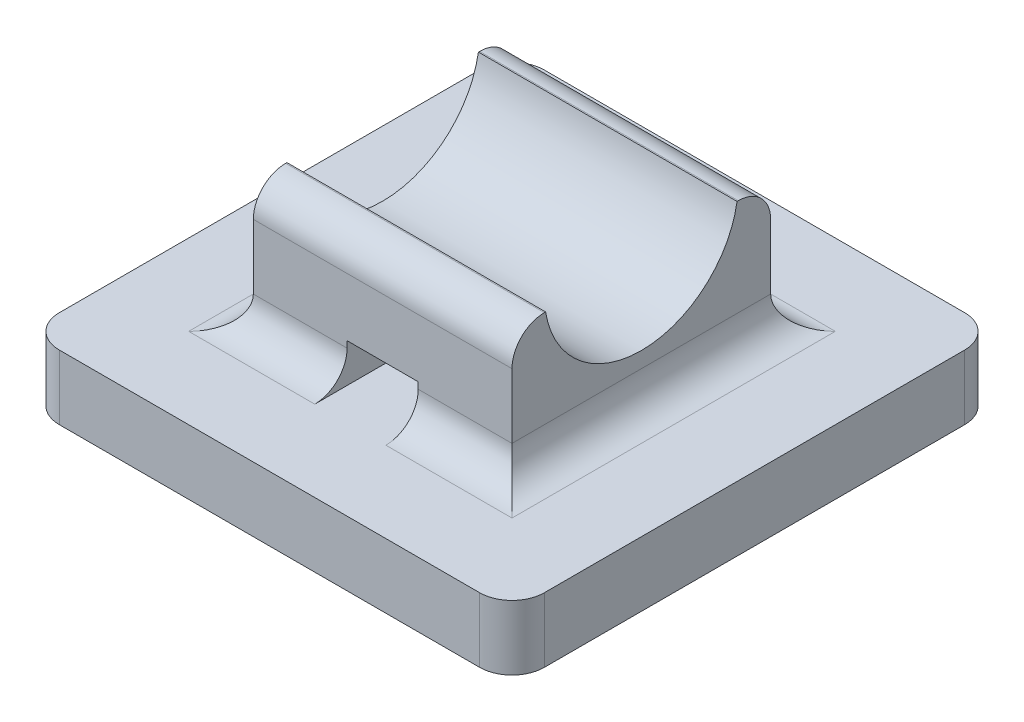
ISO-10303-21;
HEADER;
FILE_DESCRIPTION(('STEP AP214'),'2;1');
FILE_NAME('part.step','',(''),(''),'','','');
FILE_SCHEMA(('AUTOMOTIVE_DESIGN { 1 0 10303 214 1 1 1 1 }'));
ENDSEC;
DATA;
#1=APPLICATION_CONTEXT('core data for automotive mechanical design processes');
#2=APPLICATION_PROTOCOL_DEFINITION('international standard','automotive_design',2000,#1);
#3=PRODUCT_CONTEXT('',#1,'mechanical');
#4=PRODUCT('Part','Part','',(#3));
#5=PRODUCT_RELATED_PRODUCT_CATEGORY('part','',(#4));
#6=PRODUCT_DEFINITION_FORMATION('','',#4);
#7=PRODUCT_DEFINITION_CONTEXT('part definition',#1,'design');
#8=PRODUCT_DEFINITION('design','',#6,#7);
#9=PRODUCT_DEFINITION_SHAPE('','',#8);
#10=(LENGTH_UNIT() NAMED_UNIT(*) SI_UNIT(.MILLI.,.METRE.));
#11=(NAMED_UNIT(*) PLANE_ANGLE_UNIT() SI_UNIT($,.RADIAN.));
#12=(NAMED_UNIT(*) SI_UNIT($,.STERADIAN.) SOLID_ANGLE_UNIT());
#13=UNCERTAINTY_MEASURE_WITH_UNIT(LENGTH_MEASURE(1.E-05),#10,'distance_accuracy_value','');
#14=(GEOMETRIC_REPRESENTATION_CONTEXT(3) GLOBAL_UNCERTAINTY_ASSIGNED_CONTEXT((#13)) GLOBAL_UNIT_ASSIGNED_CONTEXT((#10,
#11,#12)) REPRESENTATION_CONTEXT('',''));
#15=CARTESIAN_POINT('',(0.,0.,0.));
#16=DIRECTION('',(0.,0.,1.));
#17=DIRECTION('',(1.,0.,0.));
#18=AXIS2_PLACEMENT_3D('',#15,#16,#17);
#19=CARTESIAN_POINT('',(0.,6.,0.));
#20=DIRECTION('',(0.,-1.,0.));
#21=DIRECTION('',(0.,0.,-1.));
#22=AXIS2_PLACEMENT_3D('',#19,#20,#21);
#23=PLANE('',#22);
#24=DIRECTION('',(0.,0.,-1.));
#25=VECTOR('',#24,1.);
#26=CARTESIAN_POINT('',(11.5,6.,-3.5));
#27=LINE('',#26,#25);
#28=CARTESIAN_POINT('',(11.5,6.,-10.460464320807));
#29=VERTEX_POINT('',#28);
#30=CARTESIAN_POINT('',(11.5,6.,-10.5));
#31=VERTEX_POINT('',#30);
#32=EDGE_CURVE('E240',#29,#31,#27,.T.);
#33=ORIENTED_EDGE('',*,*,#32,.T.);
#34=DIRECTION('',(-1.,0.,0.));
#35=VECTOR('',#34,1.);
#36=CARTESIAN_POINT('',(0.,6.,-10.5));
#37=LINE('',#36,#35);
#38=CARTESIAN_POINT('',(3.5,6.,-10.5));
#39=VERTEX_POINT('',#38);
#40=EDGE_CURVE('E335',#31,#39,#37,.T.);
#41=ORIENTED_EDGE('',*,*,#40,.T.);
#42=DIRECTION('',(0.,0.,1.));
#43=VECTOR('',#42,1.);
#44=CARTESIAN_POINT('',(3.5,6.,-3.5));
#45=LINE('',#44,#43);
#46=CARTESIAN_POINT('',(3.5,6.,-10.460464320807));
#47=VERTEX_POINT('',#46);
#48=EDGE_CURVE('E244',#39,#47,#45,.T.);
#49=ORIENTED_EDGE('',*,*,#48,.T.);
#50=DIRECTION('',(1.,0.,0.));
#51=VECTOR('',#50,1.);
#52=CARTESIAN_POINT('',(-4.98528137423857,6.,-10.460464320807));
#53=LINE('',#52,#51);
#54=EDGE_CURVE('E283',#47,#29,#53,.T.);
#55=ORIENTED_EDGE('',*,*,#54,.T.);
#56=EDGE_LOOP('',(#33,#41,#49,#55));
#57=FACE_BOUND('',#56,.T.);
#58=ADVANCED_FACE('F33',(#57),#23,.F.);
#59=CARTESIAN_POINT('',(0.,2.,0.));
#60=DIRECTION('',(0.,-1.,0.));
#61=DIRECTION('',(0.,0.,-1.));
#62=AXIS2_PLACEMENT_3D('',#59,#60,#61);
#63=PLANE('',#62);
#64=DIRECTION('',(-1.,0.,0.));
#65=VECTOR('',#64,1.);
#66=CARTESIAN_POINT('',(6.4,2.,-12.5));
#67=LINE('',#66,#65);
#68=CARTESIAN_POINT('',(2.5,2.,-12.5));
#69=VERTEX_POINT('',#68);
#70=CARTESIAN_POINT('',(6.4,2.,-12.5));
#71=VERTEX_POINT('',#70);
#72=EDGE_CURVE('E301',#69,#71,#67,.F.);
#73=ORIENTED_EDGE('',*,*,#72,.T.);
#74=DIRECTION('',(0.,0.,1.));
#75=VECTOR('',#74,1.);
#76=CARTESIAN_POINT('',(6.4,2.,-14.0059928172283));
#77=LINE('',#76,#75);
#78=CARTESIAN_POINT('',(6.4,2.,-2.5));
#79=VERTEX_POINT('',#78);
#80=EDGE_CURVE('E227',#71,#79,#77,.T.);
#81=ORIENTED_EDGE('',*,*,#80,.T.);
#82=DIRECTION('',(1.,0.,0.));
#83=VECTOR('',#82,1.);
#84=CARTESIAN_POINT('',(3.5,2.,-2.5));
#85=LINE('',#84,#83);
#86=CARTESIAN_POINT('',(2.5,2.,-2.5));
#87=VERTEX_POINT('',#86);
#88=EDGE_CURVE('E304',#79,#87,#85,.F.);
#89=ORIENTED_EDGE('',*,*,#88,.T.);
#90=DIRECTION('',(0.,0.,1.));
#91=VECTOR('',#90,1.);
#92=CARTESIAN_POINT('',(2.5,2.,-11.5));
#93=LINE('',#92,#91);
#94=EDGE_CURVE('E299',#87,#69,#93,.F.);
#95=ORIENTED_EDGE('',*,*,#94,.T.);
#96=EDGE_LOOP('',(#73,#81,#89,#95));
#97=FACE_BOUND('',#96,.T.);
#98=DIRECTION('',(0.,0.,-1.));
#99=VECTOR('',#98,1.);
#100=CARTESIAN_POINT('',(15.,2.,0.));
#101=LINE('',#100,#99);
#102=CARTESIAN_POINT('',(15.,2.,-1.));
#103=VERTEX_POINT('',#102);
#104=CARTESIAN_POINT('',(15.,2.,-14.));
#105=VERTEX_POINT('',#104);
#106=EDGE_CURVE('E265',#103,#105,#101,.T.);
#107=ORIENTED_EDGE('',*,*,#106,.T.);
#108=CARTESIAN_POINT('',(14.,2.,-14.));
#109=DIRECTION('',(0.,-1.,0.));
#110=DIRECTION('',(0.,0.,-1.));
#111=AXIS2_PLACEMENT_3D('',#108,#109,#110);
#112=CIRCLE('',#111,1.);
#113=CARTESIAN_POINT('',(14.,2.,-15.));
#114=VERTEX_POINT('',#113);
#115=EDGE_CURVE('E312',#105,#114,#112,.F.);
#116=ORIENTED_EDGE('',*,*,#115,.T.);
#117=DIRECTION('',(-1.,0.,0.));
#118=VECTOR('',#117,1.);
#119=CARTESIAN_POINT('',(0.,2.,-15.));
#120=LINE('',#119,#118);
#121=CARTESIAN_POINT('',(0.999999999999995,2.,-15.));
#122=VERTEX_POINT('',#121);
#123=EDGE_CURVE('E268',#114,#122,#120,.T.);
#124=ORIENTED_EDGE('',*,*,#123,.T.);
#125=CARTESIAN_POINT('',(0.999999999999995,2.,-14.));
#126=DIRECTION('',(0.,-1.,0.));
#127=DIRECTION('',(0.,0.,-1.));
#128=AXIS2_PLACEMENT_3D('',#125,#126,#127);
#129=CIRCLE('',#128,1.);
#130=CARTESIAN_POINT('',(0.,2.,-14.));
#131=VERTEX_POINT('',#130);
#132=EDGE_CURVE('E306',#122,#131,#129,.F.);
#133=ORIENTED_EDGE('',*,*,#132,.T.);
#134=DIRECTION('',(0.,0.,1.));
#135=VECTOR('',#134,1.);
#136=CARTESIAN_POINT('',(0.,2.,0.));
#137=LINE('',#136,#135);
#138=CARTESIAN_POINT('',(0.,2.,-1.));
#139=VERTEX_POINT('',#138);
#140=EDGE_CURVE('E258',#131,#139,#137,.T.);
#141=ORIENTED_EDGE('',*,*,#140,.T.);
#142=CARTESIAN_POINT('',(1.,2.,-1.));
#143=DIRECTION('',(0.,-1.,0.));
#144=DIRECTION('',(0.,0.,-1.));
#145=AXIS2_PLACEMENT_3D('',#142,#143,#144);
#146=CIRCLE('',#145,1.);
#147=CARTESIAN_POINT('',(1.,2.,0.));
#148=VERTEX_POINT('',#147);
#149=EDGE_CURVE('E308',#139,#148,#146,.F.);
#150=ORIENTED_EDGE('',*,*,#149,.T.);
#151=DIRECTION('',(1.,0.,0.));
#152=VECTOR('',#151,1.);
#153=CARTESIAN_POINT('',(0.,2.,0.));
#154=LINE('',#153,#152);
#155=CARTESIAN_POINT('',(14.,2.,0.));
#156=VERTEX_POINT('',#155);
#157=EDGE_CURVE('E261',#148,#156,#154,.T.);
#158=ORIENTED_EDGE('',*,*,#157,.T.);
#159=CARTESIAN_POINT('',(14.,2.,-1.));
#160=DIRECTION('',(0.,-1.,0.));
#161=DIRECTION('',(0.,0.,-1.));
#162=AXIS2_PLACEMENT_3D('',#159,#160,#161);
#163=CIRCLE('',#162,1.);
#164=EDGE_CURVE('E310',#156,#103,#163,.F.);
#165=ORIENTED_EDGE('',*,*,#164,.T.);
#166=EDGE_LOOP('',(#107,#116,#124,#133,#141,#150,#158,#165));
#167=FACE_BOUND('',#166,.T.);
#168=DIRECTION('',(1.,0.,0.));
#169=VECTOR('',#168,1.);
#170=CARTESIAN_POINT('',(8.6,2.,-2.5));
#171=LINE('',#170,#169);
#172=CARTESIAN_POINT('',(12.5,2.,-2.5));
#173=VERTEX_POINT('',#172);
#174=CARTESIAN_POINT('',(8.6,2.,-2.5));
#175=VERTEX_POINT('',#174);
#176=EDGE_CURVE('E296',#173,#175,#171,.F.);
#177=ORIENTED_EDGE('',*,*,#176,.T.);
#178=DIRECTION('',(0.,0.,1.));
#179=VECTOR('',#178,1.);
#180=CARTESIAN_POINT('',(8.6,2.,-14.0059928172283));
#181=LINE('',#180,#179);
#182=CARTESIAN_POINT('',(8.6,2.,-12.5));
#183=VERTEX_POINT('',#182);
#184=EDGE_CURVE('E221',#183,#175,#181,.T.);
#185=ORIENTED_EDGE('',*,*,#184,.F.);
#186=DIRECTION('',(-1.,0.,0.));
#187=VECTOR('',#186,1.);
#188=CARTESIAN_POINT('',(11.5,2.,-12.5));
#189=LINE('',#188,#187);
#190=CARTESIAN_POINT('',(12.5,2.,-12.5));
#191=VERTEX_POINT('',#190);
#192=EDGE_CURVE('E294',#183,#191,#189,.F.);
#193=ORIENTED_EDGE('',*,*,#192,.T.);
#194=DIRECTION('',(0.,0.,-1.));
#195=VECTOR('',#194,1.);
#196=CARTESIAN_POINT('',(12.5,2.,-3.5));
#197=LINE('',#196,#195);
#198=EDGE_CURVE('E292',#191,#173,#197,.F.);
#199=ORIENTED_EDGE('',*,*,#198,.T.);
#200=EDGE_LOOP('',(#177,#185,#193,#199));
#201=FACE_BOUND('',#200,.T.);
#202=ADVANCED_FACE('F455',(#97,#167,#201),#63,.F.);
#203=CARTESIAN_POINT('',(0.,2.,0.));
#204=DIRECTION('',(1.,0.,0.));
#205=DIRECTION('',(0.,0.,-1.));
#206=AXIS2_PLACEMENT_3D('',#203,#204,#205);
#207=PLANE('',#206);
#208=DIRECTION('',(0.,0.,1.));
#209=VECTOR('',#208,1.);
#210=CARTESIAN_POINT('',(0.,0.,0.));
#211=LINE('',#210,#209);
#212=CARTESIAN_POINT('',(0.,0.,-14.));
#213=VERTEX_POINT('',#212);
#214=CARTESIAN_POINT('',(0.,0.,-1.));
#215=VERTEX_POINT('',#214);
#216=EDGE_CURVE('E257',#213,#215,#211,.T.);
#217=ORIENTED_EDGE('',*,*,#216,.T.);
#218=DIRECTION('',(0.,-1.,0.));
#219=VECTOR('',#218,1.);
#220=CARTESIAN_POINT('',(0.,2.,-1.));
#221=LINE('',#220,#219);
#222=EDGE_CURVE('E361',#215,#139,#221,.F.);
#223=ORIENTED_EDGE('',*,*,#222,.T.);
#224=ORIENTED_EDGE('',*,*,#140,.F.);
#225=DIRECTION('',(0.,-1.,0.));
#226=VECTOR('',#225,1.);
#227=CARTESIAN_POINT('',(0.,2.,-14.));
#228=LINE('',#227,#226);
#229=EDGE_CURVE('E358',#131,#213,#228,.T.);
#230=ORIENTED_EDGE('',*,*,#229,.T.);
#231=EDGE_LOOP('',(#217,#223,#224,#230));
#232=FACE_BOUND('',#231,.T.);
#233=ADVANCED_FACE('F460',(#232),#207,.F.);
#234=CARTESIAN_POINT('',(0.,2.,0.));
#235=DIRECTION('',(0.,0.,-1.));
#236=DIRECTION('',(-1.,0.,0.));
#237=AXIS2_PLACEMENT_3D('',#234,#235,#236);
#238=PLANE('',#237);
#239=DIRECTION('',(1.,0.,0.));
#240=VECTOR('',#239,1.);
#241=CARTESIAN_POINT('',(0.,0.,0.));
#242=LINE('',#241,#240);
#243=CARTESIAN_POINT('',(1.,0.,0.));
#244=VERTEX_POINT('',#243);
#245=CARTESIAN_POINT('',(14.,0.,0.));
#246=VERTEX_POINT('',#245);
#247=EDGE_CURVE('E274',#244,#246,#242,.T.);
#248=ORIENTED_EDGE('',*,*,#247,.T.);
#249=DIRECTION('',(0.,-1.,0.));
#250=VECTOR('',#249,1.);
#251=CARTESIAN_POINT('',(14.,2.,0.));
#252=LINE('',#251,#250);
#253=EDGE_CURVE('E356',#246,#156,#252,.F.);
#254=ORIENTED_EDGE('',*,*,#253,.T.);
#255=ORIENTED_EDGE('',*,*,#157,.F.);
#256=DIRECTION('',(0.,-1.,0.));
#257=VECTOR('',#256,1.);
#258=CARTESIAN_POINT('',(1.,2.,0.));
#259=LINE('',#258,#257);
#260=EDGE_CURVE('E354',#148,#244,#259,.T.);
#261=ORIENTED_EDGE('',*,*,#260,.T.);
#262=EDGE_LOOP('',(#248,#254,#255,#261));
#263=FACE_BOUND('',#262,.T.);
#264=ADVANCED_FACE('F489',(#263),#238,.F.);
#265=CARTESIAN_POINT('',(15.,2.,0.));
#266=DIRECTION('',(-1.,0.,0.));
#267=DIRECTION('',(0.,0.,1.));
#268=AXIS2_PLACEMENT_3D('',#265,#266,#267);
#269=PLANE('',#268);
#270=DIRECTION('',(0.,0.,-1.));
#271=VECTOR('',#270,1.);
#272=CARTESIAN_POINT('',(15.,0.,0.));
#273=LINE('',#272,#271);
#274=CARTESIAN_POINT('',(15.,0.,-1.));
#275=VERTEX_POINT('',#274);
#276=CARTESIAN_POINT('',(15.,0.,-14.));
#277=VERTEX_POINT('',#276);
#278=EDGE_CURVE('E276',#275,#277,#273,.T.);
#279=ORIENTED_EDGE('',*,*,#278,.T.);
#280=DIRECTION('',(0.,-1.,0.));
#281=VECTOR('',#280,1.);
#282=CARTESIAN_POINT('',(15.,2.,-14.));
#283=LINE('',#282,#281);
#284=EDGE_CURVE('E352',#277,#105,#283,.F.);
#285=ORIENTED_EDGE('',*,*,#284,.T.);
#286=ORIENTED_EDGE('',*,*,#106,.F.);
#287=DIRECTION('',(0.,-1.,0.));
#288=VECTOR('',#287,1.);
#289=CARTESIAN_POINT('',(15.,2.,-1.));
#290=LINE('',#289,#288);
#291=EDGE_CURVE('E349',#103,#275,#290,.T.);
#292=ORIENTED_EDGE('',*,*,#291,.T.);
#293=EDGE_LOOP('',(#279,#285,#286,#292));
#294=FACE_BOUND('',#293,.T.);
#295=ADVANCED_FACE('F485',(#294),#269,.F.);
#296=CARTESIAN_POINT('',(0.,2.,-15.));
#297=DIRECTION('',(0.,0.,1.));
#298=DIRECTION('',(1.,0.,0.));
#299=AXIS2_PLACEMENT_3D('',#296,#297,#298);
#300=PLANE('',#299);
#301=ORIENTED_EDGE('',*,*,#123,.F.);
#302=DIRECTION('',(0.,-1.,0.));
#303=VECTOR('',#302,1.);
#304=CARTESIAN_POINT('',(14.,2.,-15.));
#305=LINE('',#304,#303);
#306=CARTESIAN_POINT('',(14.,0.,-15.));
#307=VERTEX_POINT('',#306);
#308=EDGE_CURVE('E340',#114,#307,#305,.T.);
#309=ORIENTED_EDGE('',*,*,#308,.T.);
#310=DIRECTION('',(-1.,0.,0.));
#311=VECTOR('',#310,1.);
#312=CARTESIAN_POINT('',(0.,0.,-15.));
#313=LINE('',#312,#311);
#314=CARTESIAN_POINT('',(0.999999999999995,0.,-15.));
#315=VERTEX_POINT('',#314);
#316=EDGE_CURVE('E262',#307,#315,#313,.T.);
#317=ORIENTED_EDGE('',*,*,#316,.T.);
#318=DIRECTION('',(0.,-1.,0.));
#319=VECTOR('',#318,1.);
#320=CARTESIAN_POINT('',(0.999999999999995,2.,-15.));
#321=LINE('',#320,#319);
#322=EDGE_CURVE('E338',#315,#122,#321,.F.);
#323=ORIENTED_EDGE('',*,*,#322,.T.);
#324=EDGE_LOOP('',(#301,#309,#317,#323));
#325=FACE_BOUND('',#324,.T.);
#326=ADVANCED_FACE('F482',(#325),#300,.F.);
#327=CARTESIAN_POINT('',(0.,0.,0.));
#328=DIRECTION('',(0.,-1.,0.));
#329=DIRECTION('',(0.,0.,-1.));
#330=AXIS2_PLACEMENT_3D('',#327,#328,#329);
#331=PLANE('',#330);
#332=ORIENTED_EDGE('',*,*,#316,.F.);
#333=CARTESIAN_POINT('',(14.,0.,-14.));
#334=DIRECTION('',(0.,-1.,0.));
#335=DIRECTION('',(0.,0.,-1.));
#336=AXIS2_PLACEMENT_3D('',#333,#334,#335);
#337=CIRCLE('',#336,1.);
#338=EDGE_CURVE('E347',#307,#277,#337,.T.);
#339=ORIENTED_EDGE('',*,*,#338,.T.);
#340=ORIENTED_EDGE('',*,*,#278,.F.);
#341=CARTESIAN_POINT('',(14.,0.,-1.));
#342=DIRECTION('',(0.,-1.,0.));
#343=DIRECTION('',(0.,0.,-1.));
#344=AXIS2_PLACEMENT_3D('',#341,#342,#343);
#345=CIRCLE('',#344,1.);
#346=EDGE_CURVE('E50',#275,#246,#345,.T.);
#347=ORIENTED_EDGE('',*,*,#346,.T.);
#348=ORIENTED_EDGE('',*,*,#247,.F.);
#349=CARTESIAN_POINT('',(1.,0.,-1.));
#350=DIRECTION('',(0.,-1.,0.));
#351=DIRECTION('',(0.,0.,-1.));
#352=AXIS2_PLACEMENT_3D('',#349,#350,#351);
#353=CIRCLE('',#352,1.);
#354=EDGE_CURVE('E58',#244,#215,#353,.T.);
#355=ORIENTED_EDGE('',*,*,#354,.T.);
#356=ORIENTED_EDGE('',*,*,#216,.F.);
#357=CARTESIAN_POINT('',(0.999999999999995,0.,-14.));
#358=DIRECTION('',(0.,-1.,0.));
#359=DIRECTION('',(0.,0.,-1.));
#360=AXIS2_PLACEMENT_3D('',#357,#358,#359);
#361=CIRCLE('',#360,1.);
#362=EDGE_CURVE('E343',#213,#315,#361,.T.);
#363=ORIENTED_EDGE('',*,*,#362,.T.);
#364=EDGE_LOOP('',(#332,#339,#340,#347,#348,#355,#356,#363));
#365=FACE_BOUND('',#364,.T.);
#366=ADVANCED_FACE('F478',(#365),#331,.T.);
#367=CARTESIAN_POINT('',(11.5,6.,-3.5));
#368=DIRECTION('',(-1.,0.,0.));
#369=DIRECTION('',(0.,0.,1.));
#370=AXIS2_PLACEMENT_3D('',#367,#368,#369);
#371=PLANE('',#370);
#372=CARTESIAN_POINT('',(11.5,6.,-4.5));
#373=VERTEX_POINT('',#372);
#374=CARTESIAN_POINT('',(11.5,6.,-4.53953567919297));
#375=VERTEX_POINT('',#374);
#376=EDGE_CURVE('E241',#373,#375,#27,.T.);
#377=ORIENTED_EDGE('',*,*,#376,.F.);
#378=CARTESIAN_POINT('',(11.5,5.,-4.5));
#379=DIRECTION('',(-1.,0.,0.));
#380=DIRECTION('',(0.,0.,1.));
#381=AXIS2_PLACEMENT_3D('',#378,#379,#380);
#382=CIRCLE('',#381,1.);
#383=CARTESIAN_POINT('',(11.5,5.,-3.5));
#384=VERTEX_POINT('',#383);
#385=EDGE_CURVE('E327',#373,#384,#382,.F.);
#386=ORIENTED_EDGE('',*,*,#385,.T.);
#387=DIRECTION('',(0.,-1.,0.));
#388=VECTOR('',#387,1.);
#389=CARTESIAN_POINT('',(11.5,6.,-3.5));
#390=LINE('',#389,#388);
#391=CARTESIAN_POINT('',(11.5,3.,-3.5));
#392=VERTEX_POINT('',#391);
#393=EDGE_CURVE('E246',#384,#392,#390,.T.);
#394=ORIENTED_EDGE('',*,*,#393,.T.);
#395=DIRECTION('',(0.,0.,-1.));
#396=VECTOR('',#395,1.);
#397=CARTESIAN_POINT('',(11.5,3.,-11.5));
#398=LINE('',#397,#396);
#399=CARTESIAN_POINT('',(11.5,3.,-11.5));
#400=VERTEX_POINT('',#399);
#401=EDGE_CURVE('E323',#392,#400,#398,.T.);
#402=ORIENTED_EDGE('',*,*,#401,.T.);
#403=DIRECTION('',(0.,-1.,0.));
#404=VECTOR('',#403,1.);
#405=CARTESIAN_POINT('',(11.5,6.,-11.5));
#406=LINE('',#405,#404);
#407=CARTESIAN_POINT('',(11.5,5.,-11.5));
#408=VERTEX_POINT('',#407);
#409=EDGE_CURVE('E254',#408,#400,#406,.T.);
#410=ORIENTED_EDGE('',*,*,#409,.F.);
#411=CARTESIAN_POINT('',(11.5,5.,-10.5));
#412=DIRECTION('',(-1.,0.,0.));
#413=DIRECTION('',(0.,0.,1.));
#414=AXIS2_PLACEMENT_3D('',#411,#412,#413);
#415=CIRCLE('',#414,1.);
#416=EDGE_CURVE('E325',#408,#31,#415,.F.);
#417=ORIENTED_EDGE('',*,*,#416,.T.);
#418=ORIENTED_EDGE('',*,*,#32,.F.);
#419=CARTESIAN_POINT('',(11.5,6.48543898198284,-7.5));
#420=DIRECTION('',(1.,0.,0.));
#421=DIRECTION('',(0.,0.,-1.));
#422=AXIS2_PLACEMENT_3D('',#419,#420,#421);
#423=CIRCLE('',#422,3.);
#424=EDGE_CURVE('E235',#375,#29,#423,.T.);
#425=ORIENTED_EDGE('',*,*,#424,.F.);
#426=EDGE_LOOP('',(#377,#386,#394,#402,#410,#417,#418,#425));
#427=FACE_BOUND('',#426,.T.);
#428=ADVANCED_FACE('F433',(#427),#371,.F.);
#429=CARTESIAN_POINT('',(3.5,6.,-11.5));
#430=DIRECTION('',(0.,0.,1.));
#431=DIRECTION('',(1.,0.,0.));
#432=AXIS2_PLACEMENT_3D('',#429,#430,#431);
#433=PLANE('',#432);
#434=DIRECTION('',(0.,1.,0.));
#435=VECTOR('',#434,1.);
#436=CARTESIAN_POINT('',(6.4,2.,-11.5));
#437=LINE('',#436,#435);
#438=CARTESIAN_POINT('',(6.4,3.,-11.5));
#439=VERTEX_POINT('',#438);
#440=CARTESIAN_POINT('',(6.4,3.2,-11.5));
#441=VERTEX_POINT('',#440);
#442=EDGE_CURVE('E238',#439,#441,#437,.T.);
#443=ORIENTED_EDGE('',*,*,#442,.F.);
#444=DIRECTION('',(-1.,0.,0.));
#445=VECTOR('',#444,1.);
#446=CARTESIAN_POINT('',(3.5,3.,-11.5));
#447=LINE('',#446,#445);
#448=CARTESIAN_POINT('',(3.5,3.,-11.5));
#449=VERTEX_POINT('',#448);
#450=EDGE_CURVE('E318',#439,#449,#447,.T.);
#451=ORIENTED_EDGE('',*,*,#450,.T.);
#452=DIRECTION('',(0.,-1.,0.));
#453=VECTOR('',#452,1.);
#454=CARTESIAN_POINT('',(3.5,6.,-11.5));
#455=LINE('',#454,#453);
#456=CARTESIAN_POINT('',(3.5,5.,-11.5));
#457=VERTEX_POINT('',#456);
#458=EDGE_CURVE('E251',#457,#449,#455,.T.);
#459=ORIENTED_EDGE('',*,*,#458,.F.);
#460=DIRECTION('',(-1.,0.,0.));
#461=VECTOR('',#460,1.);
#462=CARTESIAN_POINT('',(3.5,5.,-11.5));
#463=LINE('',#462,#461);
#464=EDGE_CURVE('E314',#457,#408,#463,.F.);
#465=ORIENTED_EDGE('',*,*,#464,.T.);
#466=ORIENTED_EDGE('',*,*,#409,.T.);
#467=DIRECTION('',(-1.,0.,0.));
#468=VECTOR('',#467,1.);
#469=CARTESIAN_POINT('',(8.6,3.,-11.5));
#470=LINE('',#469,#468);
#471=CARTESIAN_POINT('',(8.6,3.,-11.5));
#472=VERTEX_POINT('',#471);
#473=EDGE_CURVE('E316',#400,#472,#470,.T.);
#474=ORIENTED_EDGE('',*,*,#473,.T.);
#475=DIRECTION('',(0.,-1.,0.));
#476=VECTOR('',#475,1.);
#477=CARTESIAN_POINT('',(8.6,2.,-11.5));
#478=LINE('',#477,#476);
#479=CARTESIAN_POINT('',(8.6,3.2,-11.5));
#480=VERTEX_POINT('',#479);
#481=EDGE_CURVE('E232',#480,#472,#478,.T.);
#482=ORIENTED_EDGE('',*,*,#481,.F.);
#483=DIRECTION('',(1.,0.,0.));
#484=VECTOR('',#483,1.);
#485=CARTESIAN_POINT('',(6.4,3.2,-11.5));
#486=LINE('',#485,#484);
#487=EDGE_CURVE('E219',#441,#480,#486,.T.);
#488=ORIENTED_EDGE('',*,*,#487,.F.);
#489=EDGE_LOOP('',(#443,#451,#459,#465,#466,#474,#482,#488));
#490=FACE_BOUND('',#489,.T.);
#491=ADVANCED_FACE('F390',(#490),#433,.F.);
#492=CARTESIAN_POINT('',(3.5,6.,-3.5));
#493=DIRECTION('',(1.,0.,0.));
#494=DIRECTION('',(0.,0.,-1.));
#495=AXIS2_PLACEMENT_3D('',#492,#493,#494);
#496=PLANE('',#495);
#497=DIRECTION('',(0.,-1.,0.));
#498=VECTOR('',#497,1.);
#499=CARTESIAN_POINT('',(3.5,6.,-3.5));
#500=LINE('',#499,#498);
#501=CARTESIAN_POINT('',(3.5,5.,-3.5));
#502=VERTEX_POINT('',#501);
#503=CARTESIAN_POINT('',(3.5,3.,-3.5));
#504=VERTEX_POINT('',#503);
#505=EDGE_CURVE('E249',#502,#504,#500,.T.);
#506=ORIENTED_EDGE('',*,*,#505,.F.);
#507=CARTESIAN_POINT('',(3.5,5.,-4.5));
#508=DIRECTION('',(1.,0.,0.));
#509=DIRECTION('',(0.,0.,-1.));
#510=AXIS2_PLACEMENT_3D('',#507,#508,#509);
#511=CIRCLE('',#510,1.);
#512=CARTESIAN_POINT('',(3.5,6.,-4.5));
#513=VERTEX_POINT('',#512);
#514=EDGE_CURVE('E333',#502,#513,#511,.F.);
#515=ORIENTED_EDGE('',*,*,#514,.T.);
#516=CARTESIAN_POINT('',(3.5,6.,-4.53953567919297));
#517=VERTEX_POINT('',#516);
#518=EDGE_CURVE('E243',#517,#513,#45,.T.);
#519=ORIENTED_EDGE('',*,*,#518,.F.);
#520=CARTESIAN_POINT('',(3.5,6.48543898198284,-7.5));
#521=DIRECTION('',(1.,0.,0.));
#522=DIRECTION('',(0.,0.,-1.));
#523=AXIS2_PLACEMENT_3D('',#520,#521,#522);
#524=CIRCLE('',#523,3.);
#525=EDGE_CURVE('E237',#47,#517,#524,.F.);
#526=ORIENTED_EDGE('',*,*,#525,.F.);
#527=ORIENTED_EDGE('',*,*,#48,.F.);
#528=CARTESIAN_POINT('',(3.5,5.,-10.5));
#529=DIRECTION('',(1.,0.,0.));
#530=DIRECTION('',(0.,0.,-1.));
#531=AXIS2_PLACEMENT_3D('',#528,#529,#530);
#532=CIRCLE('',#531,1.);
#533=EDGE_CURVE('E331',#39,#457,#532,.F.);
#534=ORIENTED_EDGE('',*,*,#533,.T.);
#535=ORIENTED_EDGE('',*,*,#458,.T.);
#536=DIRECTION('',(0.,0.,1.));
#537=VECTOR('',#536,1.);
#538=CARTESIAN_POINT('',(3.5,3.,-3.5));
#539=LINE('',#538,#537);
#540=EDGE_CURVE('E329',#449,#504,#539,.T.);
#541=ORIENTED_EDGE('',*,*,#540,.T.);
#542=EDGE_LOOP('',(#506,#515,#519,#526,#527,#534,#535,#541));
#543=FACE_BOUND('',#542,.T.);
#544=ADVANCED_FACE('F413',(#543),#496,.F.);
#545=CARTESIAN_POINT('',(3.5,6.,-3.5));
#546=DIRECTION('',(0.,0.,-1.));
#547=DIRECTION('',(-1.,0.,0.));
#548=AXIS2_PLACEMENT_3D('',#545,#546,#547);
#549=PLANE('',#548);
#550=ORIENTED_EDGE('',*,*,#505,.T.);
#551=DIRECTION('',(1.,0.,0.));
#552=VECTOR('',#551,1.);
#553=CARTESIAN_POINT('',(6.4,3.,-3.5));
#554=LINE('',#553,#552);
#555=CARTESIAN_POINT('',(6.4,3.,-3.5));
#556=VERTEX_POINT('',#555);
#557=EDGE_CURVE('E290',#504,#556,#554,.T.);
#558=ORIENTED_EDGE('',*,*,#557,.T.);
#559=DIRECTION('',(0.,-1.,0.));
#560=VECTOR('',#559,1.);
#561=CARTESIAN_POINT('',(6.4,2.,-3.5));
#562=LINE('',#561,#560);
#563=CARTESIAN_POINT('',(6.4,3.2,-3.5));
#564=VERTEX_POINT('',#563);
#565=EDGE_CURVE('E211',#564,#556,#562,.T.);
#566=ORIENTED_EDGE('',*,*,#565,.F.);
#567=DIRECTION('',(-1.,0.,0.));
#568=VECTOR('',#567,1.);
#569=CARTESIAN_POINT('',(6.4,3.2,-3.5));
#570=LINE('',#569,#568);
#571=CARTESIAN_POINT('',(8.6,3.2,-3.5));
#572=VERTEX_POINT('',#571);
#573=EDGE_CURVE('E210',#572,#564,#570,.T.);
#574=ORIENTED_EDGE('',*,*,#573,.F.);
#575=DIRECTION('',(0.,1.,0.));
#576=VECTOR('',#575,1.);
#577=CARTESIAN_POINT('',(8.6,2.,-3.5));
#578=LINE('',#577,#576);
#579=CARTESIAN_POINT('',(8.6,3.,-3.5));
#580=VERTEX_POINT('',#579);
#581=EDGE_CURVE('E198',#580,#572,#578,.T.);
#582=ORIENTED_EDGE('',*,*,#581,.F.);
#583=DIRECTION('',(1.,0.,0.));
#584=VECTOR('',#583,1.);
#585=CARTESIAN_POINT('',(11.5,3.,-3.5));
#586=LINE('',#585,#584);
#587=EDGE_CURVE('E288',#580,#392,#586,.T.);
#588=ORIENTED_EDGE('',*,*,#587,.T.);
#589=ORIENTED_EDGE('',*,*,#393,.F.);
#590=DIRECTION('',(1.,0.,0.));
#591=VECTOR('',#590,1.);
#592=CARTESIAN_POINT('',(3.5,5.,-3.5));
#593=LINE('',#592,#591);
#594=EDGE_CURVE('E286',#384,#502,#593,.F.);
#595=ORIENTED_EDGE('',*,*,#594,.T.);
#596=EDGE_LOOP('',(#550,#558,#566,#574,#582,#588,#589,#595));
#597=FACE_BOUND('',#596,.T.);
#598=ADVANCED_FACE('F224',(#597),#549,.F.);
#599=ORIENTED_EDGE('',*,*,#518,.T.);
#600=DIRECTION('',(1.,0.,0.));
#601=VECTOR('',#600,1.);
#602=CARTESIAN_POINT('',(0.,6.,-4.5));
#603=LINE('',#602,#601);
#604=EDGE_CURVE('E320',#513,#373,#603,.T.);
#605=ORIENTED_EDGE('',*,*,#604,.T.);
#606=ORIENTED_EDGE('',*,*,#376,.T.);
#607=DIRECTION('',(1.,0.,0.));
#608=VECTOR('',#607,1.);
#609=CARTESIAN_POINT('',(-4.98528137423857,6.,-4.53953567919297));
#610=LINE('',#609,#608);
#611=EDGE_CURVE('E271',#375,#517,#610,.F.);
#612=ORIENTED_EDGE('',*,*,#611,.T.);
#613=EDGE_LOOP('',(#599,#605,#606,#612));
#614=FACE_BOUND('',#613,.T.);
#615=ADVANCED_FACE('F424',(#614),#23,.F.);
#616=CARTESIAN_POINT('',(-4.98528137423857,6.48543898198284,-7.5));
#617=DIRECTION('',(1.,0.,0.));
#618=DIRECTION('',(0.,0.,-1.));
#619=AXIS2_PLACEMENT_3D('',#616,#617,#618);
#620=CYLINDRICAL_SURFACE('',#619,3.);
#621=ORIENTED_EDGE('',*,*,#525,.T.);
#622=ORIENTED_EDGE('',*,*,#611,.F.);
#623=ORIENTED_EDGE('',*,*,#424,.T.);
#624=ORIENTED_EDGE('',*,*,#54,.F.);
#625=EDGE_LOOP('',(#621,#622,#623,#624));
#626=FACE_BOUND('',#625,.T.);
#627=ADVANCED_FACE('F429',(#626),#620,.F.);
#628=CARTESIAN_POINT('',(6.4,2.,-14.0059928172283));
#629=DIRECTION('',(-1.,0.,0.));
#630=DIRECTION('',(0.,-1.,0.));
#631=AXIS2_PLACEMENT_3D('',#628,#629,#630);
#632=PLANE('',#631);
#633=ORIENTED_EDGE('',*,*,#80,.F.);
#634=CARTESIAN_POINT('',(6.4,3.,-12.5));
#635=DIRECTION('',(-1.,0.,0.));
#636=DIRECTION('',(0.,-1.,0.));
#637=AXIS2_PLACEMENT_3D('',#634,#635,#636);
#638=CIRCLE('',#637,1.);
#639=EDGE_CURVE('E42',#71,#439,#638,.T.);
#640=ORIENTED_EDGE('',*,*,#639,.T.);
#641=ORIENTED_EDGE('',*,*,#442,.T.);
#642=DIRECTION('',(0.,0.,1.));
#643=VECTOR('',#642,1.);
#644=CARTESIAN_POINT('',(6.4,3.2,-14.0059928172283));
#645=LINE('',#644,#643);
#646=EDGE_CURVE('E220',#441,#564,#645,.T.);
#647=ORIENTED_EDGE('',*,*,#646,.T.);
#648=ORIENTED_EDGE('',*,*,#565,.T.);
#649=CARTESIAN_POINT('',(6.4,3.,-2.5));
#650=DIRECTION('',(-1.,0.,0.));
#651=DIRECTION('',(0.,-1.,0.));
#652=AXIS2_PLACEMENT_3D('',#649,#650,#651);
#653=CIRCLE('',#652,1.);
#654=EDGE_CURVE('E363',#556,#79,#653,.T.);
#655=ORIENTED_EDGE('',*,*,#654,.T.);
#656=EDGE_LOOP('',(#633,#640,#641,#647,#648,#655));
#657=FACE_BOUND('',#656,.T.);
#658=ADVANCED_FACE('F396',(#657),#632,.F.);
#659=CARTESIAN_POINT('',(6.4,3.2,-14.0059928172283));
#660=DIRECTION('',(0.,1.,0.));
#661=DIRECTION('',(0.,0.,1.));
#662=AXIS2_PLACEMENT_3D('',#659,#660,#661);
#663=PLANE('',#662);
#664=ORIENTED_EDGE('',*,*,#487,.T.);
#665=DIRECTION('',(0.,0.,1.));
#666=VECTOR('',#665,1.);
#667=CARTESIAN_POINT('',(8.6,3.2,-14.0059928172283));
#668=LINE('',#667,#666);
#669=EDGE_CURVE('E202',#480,#572,#668,.T.);
#670=ORIENTED_EDGE('',*,*,#669,.T.);
#671=ORIENTED_EDGE('',*,*,#573,.T.);
#672=ORIENTED_EDGE('',*,*,#646,.F.);
#673=EDGE_LOOP('',(#664,#670,#671,#672));
#674=FACE_BOUND('',#673,.T.);
#675=ADVANCED_FACE('F215',(#674),#663,.F.);
#676=CARTESIAN_POINT('',(8.6,2.,-14.0059928172283));
#677=DIRECTION('',(1.,0.,0.));
#678=DIRECTION('',(0.,0.,-1.));
#679=AXIS2_PLACEMENT_3D('',#676,#677,#678);
#680=PLANE('',#679);
#681=ORIENTED_EDGE('',*,*,#481,.T.);
#682=CARTESIAN_POINT('',(8.6,3.,-12.5));
#683=DIRECTION('',(1.,0.,0.));
#684=DIRECTION('',(0.,0.,-1.));
#685=AXIS2_PLACEMENT_3D('',#682,#683,#684);
#686=CIRCLE('',#685,1.);
#687=EDGE_CURVE('E11',#472,#183,#686,.T.);
#688=ORIENTED_EDGE('',*,*,#687,.T.);
#689=ORIENTED_EDGE('',*,*,#184,.T.);
#690=CARTESIAN_POINT('',(8.6,3.,-2.5));
#691=DIRECTION('',(1.,0.,0.));
#692=DIRECTION('',(0.,0.,-1.));
#693=AXIS2_PLACEMENT_3D('',#690,#691,#692);
#694=CIRCLE('',#693,1.);
#695=EDGE_CURVE('E205',#175,#580,#694,.T.);
#696=ORIENTED_EDGE('',*,*,#695,.T.);
#697=ORIENTED_EDGE('',*,*,#581,.T.);
#698=ORIENTED_EDGE('',*,*,#669,.F.);
#699=EDGE_LOOP('',(#681,#688,#689,#696,#697,#698));
#700=FACE_BOUND('',#699,.T.);
#701=ADVANCED_FACE('F201',(#700),#680,.F.);
#702=CARTESIAN_POINT('',(3.5,3.,-12.5));
#703=DIRECTION('',(1.,0.,0.));
#704=DIRECTION('',(0.,0.,-1.));
#705=AXIS2_PLACEMENT_3D('',#702,#703,#704);
#706=CYLINDRICAL_SURFACE('',#705,1.);
#707=ORIENTED_EDGE('',*,*,#639,.F.);
#708=ORIENTED_EDGE('',*,*,#72,.F.);
#709=CARTESIAN_POINT('',(2.5,3.,-12.5));
#710=DIRECTION('',(0.707106781186547,0.,-0.707106781186547));
#711=DIRECTION('',(-0.707106781186547,0.,-0.707106781186547));
#712=AXIS2_PLACEMENT_3D('',#709,#710,#711);
#713=ELLIPSE('',#712,1.41421356237309,1.);
#714=EDGE_CURVE('E371',#449,#69,#713,.T.);
#715=ORIENTED_EDGE('',*,*,#714,.F.);
#716=ORIENTED_EDGE('',*,*,#450,.F.);
#717=EDGE_LOOP('',(#707,#708,#715,#716));
#718=FACE_BOUND('',#717,.T.);
#719=ADVANCED_FACE('F403',(#718),#706,.F.);
#720=CARTESIAN_POINT('',(2.5,3.,-3.5));
#721=DIRECTION('',(0.,0.,-1.));
#722=DIRECTION('',(-1.,0.,0.));
#723=AXIS2_PLACEMENT_3D('',#720,#721,#722);
#724=CYLINDRICAL_SURFACE('',#723,1.);
#725=ORIENTED_EDGE('',*,*,#714,.T.);
#726=ORIENTED_EDGE('',*,*,#94,.F.);
#727=CARTESIAN_POINT('',(2.5,3.,-2.5));
#728=DIRECTION('',(-0.707106781186547,0.,-0.707106781186547));
#729=DIRECTION('',(0.707106781186547,0.,-0.707106781186547));
#730=AXIS2_PLACEMENT_3D('',#727,#728,#729);
#731=ELLIPSE('',#730,1.41421356237309,1.);
#732=EDGE_CURVE('E368',#504,#87,#731,.T.);
#733=ORIENTED_EDGE('',*,*,#732,.F.);
#734=ORIENTED_EDGE('',*,*,#540,.F.);
#735=EDGE_LOOP('',(#725,#726,#733,#734));
#736=FACE_BOUND('',#735,.T.);
#737=ADVANCED_FACE('F409',(#736),#724,.F.);
#738=CARTESIAN_POINT('',(3.5,3.,-2.5));
#739=DIRECTION('',(-1.,0.,0.));
#740=DIRECTION('',(0.,0.,1.));
#741=AXIS2_PLACEMENT_3D('',#738,#739,#740);
#742=CYLINDRICAL_SURFACE('',#741,1.);
#743=ORIENTED_EDGE('',*,*,#732,.T.);
#744=ORIENTED_EDGE('',*,*,#88,.F.);
#745=ORIENTED_EDGE('',*,*,#654,.F.);
#746=ORIENTED_EDGE('',*,*,#557,.F.);
#747=EDGE_LOOP('',(#743,#744,#745,#746));
#748=FACE_BOUND('',#747,.T.);
#749=ADVANCED_FACE('F497',(#748),#742,.F.);
#750=CARTESIAN_POINT('',(3.5,3.,-12.5));
#751=DIRECTION('',(1.,0.,0.));
#752=DIRECTION('',(0.,0.,-1.));
#753=AXIS2_PLACEMENT_3D('',#750,#751,#752);
#754=CYLINDRICAL_SURFACE('',#753,1.);
#755=ORIENTED_EDGE('',*,*,#687,.F.);
#756=ORIENTED_EDGE('',*,*,#473,.F.);
#757=CARTESIAN_POINT('',(12.5,3.,-12.5));
#758=DIRECTION('',(0.707106781186547,0.,0.707106781186547));
#759=DIRECTION('',(-0.707106781186547,0.,0.707106781186547));
#760=AXIS2_PLACEMENT_3D('',#757,#758,#759);
#761=ELLIPSE('',#760,1.41421356237309,1.);
#762=EDGE_CURVE('E37',#191,#400,#761,.F.);
#763=ORIENTED_EDGE('',*,*,#762,.F.);
#764=ORIENTED_EDGE('',*,*,#192,.F.);
#765=EDGE_LOOP('',(#755,#756,#763,#764));
#766=FACE_BOUND('',#765,.T.);
#767=ADVANCED_FACE('F387',(#766),#754,.F.);
#768=CARTESIAN_POINT('',(12.5,3.,-3.5));
#769=DIRECTION('',(0.,0.,1.));
#770=DIRECTION('',(1.,0.,0.));
#771=AXIS2_PLACEMENT_3D('',#768,#769,#770);
#772=CYLINDRICAL_SURFACE('',#771,1.);
#773=ORIENTED_EDGE('',*,*,#762,.T.);
#774=ORIENTED_EDGE('',*,*,#401,.F.);
#775=CARTESIAN_POINT('',(12.5,3.,-2.5));
#776=DIRECTION('',(-0.707106781186547,0.,0.707106781186547));
#777=DIRECTION('',(0.707106781186547,0.,0.707106781186547));
#778=AXIS2_PLACEMENT_3D('',#775,#776,#777);
#779=ELLIPSE('',#778,1.41421356237309,1.);
#780=EDGE_CURVE('E373',#173,#392,#779,.F.);
#781=ORIENTED_EDGE('',*,*,#780,.F.);
#782=ORIENTED_EDGE('',*,*,#198,.F.);
#783=EDGE_LOOP('',(#773,#774,#781,#782));
#784=FACE_BOUND('',#783,.T.);
#785=ADVANCED_FACE('F382',(#784),#772,.F.);
#786=CARTESIAN_POINT('',(3.5,3.,-2.5));
#787=DIRECTION('',(-1.,0.,0.));
#788=DIRECTION('',(0.,0.,1.));
#789=AXIS2_PLACEMENT_3D('',#786,#787,#788);
#790=CYLINDRICAL_SURFACE('',#789,1.);
#791=ORIENTED_EDGE('',*,*,#695,.F.);
#792=ORIENTED_EDGE('',*,*,#176,.F.);
#793=ORIENTED_EDGE('',*,*,#780,.T.);
#794=ORIENTED_EDGE('',*,*,#587,.F.);
#795=EDGE_LOOP('',(#791,#792,#793,#794));
#796=FACE_BOUND('',#795,.T.);
#797=ADVANCED_FACE('F452',(#796),#790,.F.);
#798=CARTESIAN_POINT('',(0.,5.,-4.5));
#799=DIRECTION('',(1.,0.,0.));
#800=DIRECTION('',(0.,0.,-1.));
#801=AXIS2_PLACEMENT_3D('',#798,#799,#800);
#802=CYLINDRICAL_SURFACE('',#801,1.);
#803=ORIENTED_EDGE('',*,*,#514,.F.);
#804=ORIENTED_EDGE('',*,*,#594,.F.);
#805=ORIENTED_EDGE('',*,*,#385,.F.);
#806=ORIENTED_EDGE('',*,*,#604,.F.);
#807=EDGE_LOOP('',(#803,#804,#805,#806));
#808=FACE_BOUND('',#807,.T.);
#809=ADVANCED_FACE('F418',(#808),#802,.T.);
#810=CARTESIAN_POINT('',(0.,5.,-10.5));
#811=DIRECTION('',(-1.,0.,0.));
#812=DIRECTION('',(0.,0.,1.));
#813=AXIS2_PLACEMENT_3D('',#810,#811,#812);
#814=CYLINDRICAL_SURFACE('',#813,1.);
#815=ORIENTED_EDGE('',*,*,#416,.F.);
#816=ORIENTED_EDGE('',*,*,#464,.F.);
#817=ORIENTED_EDGE('',*,*,#533,.F.);
#818=ORIENTED_EDGE('',*,*,#40,.F.);
#819=EDGE_LOOP('',(#815,#816,#817,#818));
#820=FACE_BOUND('',#819,.T.);
#821=ADVANCED_FACE('F440',(#820),#814,.T.);
#822=CARTESIAN_POINT('',(14.,2.,-14.));
#823=DIRECTION('',(0.,-1.,0.));
#824=DIRECTION('',(0.,0.,-1.));
#825=AXIS2_PLACEMENT_3D('',#822,#823,#824);
#826=CYLINDRICAL_SURFACE('',#825,1.);
#827=ORIENTED_EDGE('',*,*,#115,.F.);
#828=ORIENTED_EDGE('',*,*,#284,.F.);
#829=ORIENTED_EDGE('',*,*,#338,.F.);
#830=ORIENTED_EDGE('',*,*,#308,.F.);
#831=EDGE_LOOP('',(#827,#828,#829,#830));
#832=FACE_BOUND('',#831,.T.);
#833=ADVANCED_FACE('F443',(#832),#826,.T.);
#834=CARTESIAN_POINT('',(14.,2.,-1.));
#835=DIRECTION('',(0.,-1.,0.));
#836=DIRECTION('',(0.,0.,-1.));
#837=AXIS2_PLACEMENT_3D('',#834,#835,#836);
#838=CYLINDRICAL_SURFACE('',#837,1.);
#839=ORIENTED_EDGE('',*,*,#164,.F.);
#840=ORIENTED_EDGE('',*,*,#253,.F.);
#841=ORIENTED_EDGE('',*,*,#346,.F.);
#842=ORIENTED_EDGE('',*,*,#291,.F.);
#843=EDGE_LOOP('',(#839,#840,#841,#842));
#844=FACE_BOUND('',#843,.T.);
#845=ADVANCED_FACE('F449',(#844),#838,.T.);
#846=CARTESIAN_POINT('',(1.,2.,-1.));
#847=DIRECTION('',(0.,-1.,0.));
#848=DIRECTION('',(0.,0.,-1.));
#849=AXIS2_PLACEMENT_3D('',#846,#847,#848);
#850=CYLINDRICAL_SURFACE('',#849,1.);
#851=ORIENTED_EDGE('',*,*,#149,.F.);
#852=ORIENTED_EDGE('',*,*,#222,.F.);
#853=ORIENTED_EDGE('',*,*,#354,.F.);
#854=ORIENTED_EDGE('',*,*,#260,.F.);
#855=EDGE_LOOP('',(#851,#852,#853,#854));
#856=FACE_BOUND('',#855,.T.);
#857=ADVANCED_FACE('F545',(#856),#850,.T.);
#858=CARTESIAN_POINT('',(0.999999999999995,2.,-14.));
#859=DIRECTION('',(0.,-1.,0.));
#860=DIRECTION('',(0.,0.,-1.));
#861=AXIS2_PLACEMENT_3D('',#858,#859,#860);
#862=CYLINDRICAL_SURFACE('',#861,1.);
#863=ORIENTED_EDGE('',*,*,#132,.F.);
#864=ORIENTED_EDGE('',*,*,#322,.F.);
#865=ORIENTED_EDGE('',*,*,#362,.F.);
#866=ORIENTED_EDGE('',*,*,#229,.F.);
#867=EDGE_LOOP('',(#863,#864,#865,#866));
#868=FACE_BOUND('',#867,.T.);
#869=ADVANCED_FACE('F35',(#868),#862,.T.);
#870=CLOSED_SHELL('',(#58,#202,#233,#264,#295,#326,#366,#428,#491,#544,#598,#615,#627,#658,#675,
#701,#719,#737,#749,#767,#785,#797,#809,#821,#833,#845,#857,#869));
#871=MANIFOLD_SOLID_BREP('B2',#870);
#872=ADVANCED_BREP_SHAPE_REPRESENTATION('',(#18,#871),#14);
#873=SHAPE_DEFINITION_REPRESENTATION(#9,#872);
ENDSEC;
END-ISO-10303-21;
